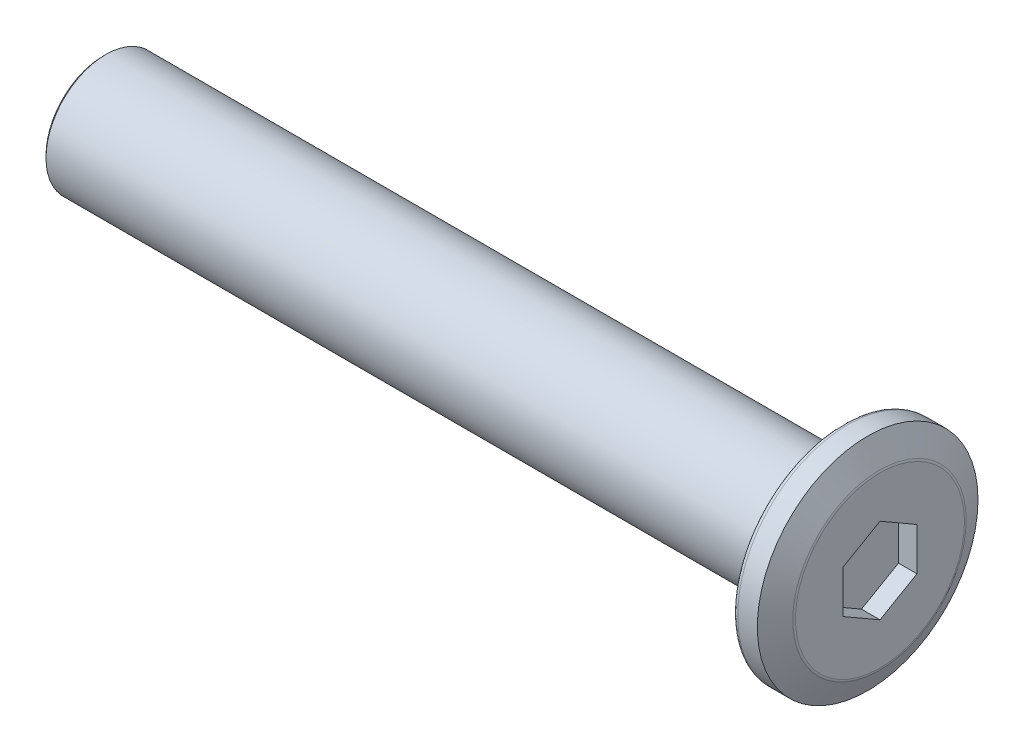
ISO-10303-21;
HEADER;
FILE_DESCRIPTION(('STEP AP214'),'2;1');
FILE_NAME('part.step','',(''),(''),'','','');
FILE_SCHEMA(('AUTOMOTIVE_DESIGN { 1 0 10303 214 1 1 1 1 }'));
ENDSEC;
DATA;
#1=APPLICATION_CONTEXT('core data for automotive mechanical design processes');
#2=APPLICATION_PROTOCOL_DEFINITION('international standard','automotive_design',2000,#1);
#3=PRODUCT_CONTEXT('',#1,'mechanical');
#4=PRODUCT('Part','Part','',(#3));
#5=PRODUCT_RELATED_PRODUCT_CATEGORY('part','',(#4));
#6=PRODUCT_DEFINITION_FORMATION('','',#4);
#7=PRODUCT_DEFINITION_CONTEXT('part definition',#1,'design');
#8=PRODUCT_DEFINITION('design','',#6,#7);
#9=PRODUCT_DEFINITION_SHAPE('','',#8);
#10=(LENGTH_UNIT() NAMED_UNIT(*) SI_UNIT(.MILLI.,.METRE.));
#11=(NAMED_UNIT(*) PLANE_ANGLE_UNIT() SI_UNIT($,.RADIAN.));
#12=(NAMED_UNIT(*) SI_UNIT($,.STERADIAN.) SOLID_ANGLE_UNIT());
#13=UNCERTAINTY_MEASURE_WITH_UNIT(LENGTH_MEASURE(1.E-05),#10,'distance_accuracy_value','');
#14=(GEOMETRIC_REPRESENTATION_CONTEXT(3) GLOBAL_UNCERTAINTY_ASSIGNED_CONTEXT((#13)) GLOBAL_UNIT_ASSIGNED_CONTEXT((#10,
#11,#12)) REPRESENTATION_CONTEXT('',''));
#15=CARTESIAN_POINT('',(0.,0.,0.));
#16=DIRECTION('',(0.,0.,1.));
#17=DIRECTION('',(1.,0.,0.));
#18=AXIS2_PLACEMENT_3D('',#15,#16,#17);
#19=CARTESIAN_POINT('',(0.75,0.,0.));
#20=DIRECTION('',(1.,0.,0.));
#21=DIRECTION('',(0.,0.,-1.));
#22=AXIS2_PLACEMENT_3D('',#19,#20,#21);
#23=PLANE('',#22);
#24=CARTESIAN_POINT('',(0.75,0.,0.));
#25=DIRECTION('',(1.,0.,0.));
#26=DIRECTION('',(0.,0.,-1.));
#27=AXIS2_PLACEMENT_3D('',#24,#25,#26);
#28=CIRCLE('',#27,3.42778640450004);
#29=CARTESIAN_POINT('',(0.75,0.,-3.42778640450004));
#30=VERTEX_POINT('',#29);
#31=EDGE_CURVE('E132',#30,#30,#28,.T.);
#32=ORIENTED_EDGE('',*,*,#31,.T.);
#33=EDGE_LOOP('',(#32));
#34=FACE_BOUND('',#33,.T.);
#35=DIRECTION('',(0.,-1.,0.));
#36=VECTOR('',#35,1.);
#37=CARTESIAN_POINT('',(0.75,0.,-1.5));
#38=LINE('',#37,#36);
#39=CARTESIAN_POINT('',(0.75,0.866025403784438,-1.5));
#40=VERTEX_POINT('',#39);
#41=CARTESIAN_POINT('',(0.75,-0.866025403784439,-1.5));
#42=VERTEX_POINT('',#41);
#43=EDGE_CURVE('E120',#40,#42,#38,.T.);
#44=ORIENTED_EDGE('',*,*,#43,.T.);
#45=DIRECTION('',(0.,-0.5,0.866025403784439));
#46=VECTOR('',#45,1.);
#47=CARTESIAN_POINT('',(0.75,-1.29903810567666,-0.75));
#48=LINE('',#47,#46);
#49=CARTESIAN_POINT('',(0.75,-1.73205080756888,0.));
#50=VERTEX_POINT('',#49);
#51=EDGE_CURVE('E40',#42,#50,#48,.T.);
#52=ORIENTED_EDGE('',*,*,#51,.T.);
#53=DIRECTION('',(0.,0.5,0.866025403784439));
#54=VECTOR('',#53,1.);
#55=CARTESIAN_POINT('',(0.75,-1.29903810567666,0.75));
#56=LINE('',#55,#54);
#57=CARTESIAN_POINT('',(0.75,-0.866025403784438,1.5));
#58=VERTEX_POINT('',#57);
#59=EDGE_CURVE('E76',#50,#58,#56,.T.);
#60=ORIENTED_EDGE('',*,*,#59,.T.);
#61=DIRECTION('',(0.,1.,0.));
#62=VECTOR('',#61,1.);
#63=CARTESIAN_POINT('',(0.75,0.,1.5));
#64=LINE('',#63,#62);
#65=CARTESIAN_POINT('',(0.75,0.866025403784439,1.5));
#66=VERTEX_POINT('',#65);
#67=EDGE_CURVE('E111',#58,#66,#64,.T.);
#68=ORIENTED_EDGE('',*,*,#67,.T.);
#69=DIRECTION('',(0.,0.5,-0.866025403784439));
#70=VECTOR('',#69,1.);
#71=CARTESIAN_POINT('',(0.75,1.29903810567666,0.75));
#72=LINE('',#71,#70);
#73=CARTESIAN_POINT('',(0.75,1.73205080756888,0.));
#74=VERTEX_POINT('',#73);
#75=EDGE_CURVE('E114',#66,#74,#72,.T.);
#76=ORIENTED_EDGE('',*,*,#75,.T.);
#77=DIRECTION('',(0.,-0.5,-0.866025403784439));
#78=VECTOR('',#77,1.);
#79=CARTESIAN_POINT('',(0.75,1.29903810567666,-0.75));
#80=LINE('',#79,#78);
#81=EDGE_CURVE('E117',#74,#40,#80,.T.);
#82=ORIENTED_EDGE('',*,*,#81,.T.);
#83=EDGE_LOOP('',(#44,#52,#60,#68,#76,#82));
#84=FACE_BOUND('',#83,.T.);
#85=ADVANCED_FACE('F16',(#34,#84),#23,.T.);
#86=CARTESIAN_POINT('',(-0.75,0.,0.));
#87=DIRECTION('',(1.,0.,0.));
#88=DIRECTION('',(0.,0.,-1.));
#89=AXIS2_PLACEMENT_3D('',#86,#87,#88);
#90=PLANE('',#89);
#91=CARTESIAN_POINT('',(-0.75,0.,0.));
#92=DIRECTION('',(1.,0.,0.));
#93=DIRECTION('',(0.,0.,-1.));
#94=AXIS2_PLACEMENT_3D('',#91,#92,#93);
#95=CIRCLE('',#94,4.275);
#96=CARTESIAN_POINT('',(-0.75,0.,-4.275));
#97=VERTEX_POINT('',#96);
#98=EDGE_CURVE('E141',#97,#97,#95,.F.);
#99=ORIENTED_EDGE('',*,*,#98,.T.);
#100=EDGE_LOOP('',(#99));
#101=FACE_BOUND('',#100,.T.);
#102=CARTESIAN_POINT('',(-0.75,0.,0.));
#103=DIRECTION('',(1.,0.,0.));
#104=DIRECTION('',(0.,0.,-1.));
#105=AXIS2_PLACEMENT_3D('',#102,#103,#104);
#106=CIRCLE('',#105,2.675);
#107=CARTESIAN_POINT('',(-0.75,0.,-2.675));
#108=VERTEX_POINT('',#107);
#109=EDGE_CURVE('E129',#108,#108,#106,.T.);
#110=ORIENTED_EDGE('',*,*,#109,.T.);
#111=EDGE_LOOP('',(#110));
#112=FACE_BOUND('',#111,.T.);
#113=ADVANCED_FACE('F159',(#101,#112),#90,.F.);
#114=CARTESIAN_POINT('',(0.75,0.,0.));
#115=DIRECTION('',(-1.,0.,0.));
#116=DIRECTION('',(0.,0.,1.));
#117=AXIS2_PLACEMENT_3D('',#114,#115,#116);
#118=CYLINDRICAL_SURFACE('',#117,4.475);
#119=CARTESIAN_POINT('',(-0.55,0.,0.));
#120=DIRECTION('',(1.,0.,0.));
#121=DIRECTION('',(0.,0.,-1.));
#122=AXIS2_PLACEMENT_3D('',#119,#120,#121);
#123=CIRCLE('',#122,4.475);
#124=CARTESIAN_POINT('',(-0.55,0.,-4.475));
#125=VERTEX_POINT('',#124);
#126=EDGE_CURVE('E138',#125,#125,#123,.T.);
#127=ORIENTED_EDGE('',*,*,#126,.T.);
#128=EDGE_LOOP('',(#127));
#129=FACE_BOUND('',#128,.T.);
#130=CARTESIAN_POINT('',(0.250000000000004,0.,0.));
#131=DIRECTION('',(1.,0.,0.));
#132=DIRECTION('',(0.,0.,-1.));
#133=AXIS2_PLACEMENT_3D('',#130,#131,#132);
#134=CIRCLE('',#133,4.475);
#135=CARTESIAN_POINT('',(0.250000000000004,0.,-4.475));
#136=VERTEX_POINT('',#135);
#137=EDGE_CURVE('E123',#136,#136,#134,.F.);
#138=ORIENTED_EDGE('',*,*,#137,.T.);
#139=EDGE_LOOP('',(#138));
#140=FACE_BOUND('',#139,.T.);
#141=ADVANCED_FACE('F165',(#129,#140),#118,.T.);
#142=CARTESIAN_POINT('',(-30.75,0.,0.));
#143=DIRECTION('',(1.,0.,0.));
#144=DIRECTION('',(0.,0.,-1.));
#145=AXIS2_PLACEMENT_3D('',#142,#143,#144);
#146=CYLINDRICAL_SURFACE('',#145,2.425);
#147=CARTESIAN_POINT('',(-30.65,0.,0.));
#148=DIRECTION('',(-1.,0.,0.));
#149=DIRECTION('',(0.,0.,1.));
#150=AXIS2_PLACEMENT_3D('',#147,#148,#149);
#151=CIRCLE('',#150,2.425);
#152=CARTESIAN_POINT('',(-30.65,0.,2.425));
#153=VERTEX_POINT('',#152);
#154=EDGE_CURVE('E10',#153,#153,#151,.F.);
#155=ORIENTED_EDGE('',*,*,#154,.T.);
#156=EDGE_LOOP('',(#155));
#157=FACE_BOUND('',#156,.T.);
#158=CARTESIAN_POINT('',(-1.,0.,0.));
#159=DIRECTION('',(1.,0.,0.));
#160=DIRECTION('',(0.,0.,-1.));
#161=AXIS2_PLACEMENT_3D('',#158,#159,#160);
#162=CIRCLE('',#161,2.425);
#163=CARTESIAN_POINT('',(-1.,0.,-2.425));
#164=VERTEX_POINT('',#163);
#165=EDGE_CURVE('E126',#164,#164,#162,.F.);
#166=ORIENTED_EDGE('',*,*,#165,.T.);
#167=EDGE_LOOP('',(#166));
#168=FACE_BOUND('',#167,.T.);
#169=ADVANCED_FACE('F170',(#157,#168),#146,.T.);
#170=CARTESIAN_POINT('',(-30.75,0.,0.));
#171=DIRECTION('',(-1.,0.,0.));
#172=DIRECTION('',(0.,0.,1.));
#173=AXIS2_PLACEMENT_3D('',#170,#171,#172);
#174=PLANE('',#173);
#175=CARTESIAN_POINT('',(-30.75,0.,0.));
#176=DIRECTION('',(-1.,0.,0.));
#177=DIRECTION('',(0.,0.,1.));
#178=AXIS2_PLACEMENT_3D('',#175,#176,#177);
#179=CIRCLE('',#178,2.325);
#180=CARTESIAN_POINT('',(-30.75,0.,2.325));
#181=VERTEX_POINT('',#180);
#182=EDGE_CURVE('E25',#181,#181,#179,.T.);
#183=ORIENTED_EDGE('',*,*,#182,.T.);
#184=EDGE_LOOP('',(#183));
#185=FACE_BOUND('',#184,.T.);
#186=ADVANCED_FACE('F146',(#185),#174,.T.);
#187=CARTESIAN_POINT('',(2.,-1.73205080756888,0.));
#188=DIRECTION('',(0.,0.866025403784439,0.5));
#189=DIRECTION('',(0.,-0.5,0.866025403784439));
#190=AXIS2_PLACEMENT_3D('',#187,#188,#189);
#191=PLANE('',#190);
#192=DIRECTION('',(-1.,0.,0.));
#193=VECTOR('',#192,1.);
#194=CARTESIAN_POINT('',(2.,-0.866025403784439,-1.5));
#195=LINE('',#194,#193);
#196=CARTESIAN_POINT('',(0.,-0.866025403784439,-1.5));
#197=VERTEX_POINT('',#196);
#198=EDGE_CURVE('E69',#42,#197,#195,.T.);
#199=ORIENTED_EDGE('',*,*,#198,.T.);
#200=DIRECTION('',(0.,0.5,-0.866025403784439));
#201=VECTOR('',#200,1.);
#202=CARTESIAN_POINT('',(0.,-1.73205080756888,0.));
#203=LINE('',#202,#201);
#204=CARTESIAN_POINT('',(0.,-1.73205080756888,0.));
#205=VERTEX_POINT('',#204);
#206=EDGE_CURVE('E73',#205,#197,#203,.T.);
#207=ORIENTED_EDGE('',*,*,#206,.F.);
#208=DIRECTION('',(-1.,0.,0.));
#209=VECTOR('',#208,1.);
#210=CARTESIAN_POINT('',(2.,-1.73205080756888,0.));
#211=LINE('',#210,#209);
#212=EDGE_CURVE('E101',#50,#205,#211,.T.);
#213=ORIENTED_EDGE('',*,*,#212,.F.);
#214=ORIENTED_EDGE('',*,*,#51,.F.);
#215=EDGE_LOOP('',(#199,#207,#213,#214));
#216=FACE_BOUND('',#215,.T.);
#217=ADVANCED_FACE('F71',(#216),#191,.T.);
#218=CARTESIAN_POINT('',(2.,-0.866025403784439,-1.5));
#219=DIRECTION('',(0.,0.,1.));
#220=DIRECTION('',(1.,0.,0.));
#221=AXIS2_PLACEMENT_3D('',#218,#219,#220);
#222=PLANE('',#221);
#223=DIRECTION('',(-1.,0.,0.));
#224=VECTOR('',#223,1.);
#225=CARTESIAN_POINT('',(2.,0.866025403784438,-1.5));
#226=LINE('',#225,#224);
#227=CARTESIAN_POINT('',(0.,0.866025403784438,-1.5));
#228=VERTEX_POINT('',#227);
#229=EDGE_CURVE('E77',#40,#228,#226,.T.);
#230=ORIENTED_EDGE('',*,*,#229,.T.);
#231=DIRECTION('',(0.,1.,0.));
#232=VECTOR('',#231,1.);
#233=CARTESIAN_POINT('',(0.,-0.866025403784439,-1.5));
#234=LINE('',#233,#232);
#235=EDGE_CURVE('E80',#197,#228,#234,.T.);
#236=ORIENTED_EDGE('',*,*,#235,.F.);
#237=ORIENTED_EDGE('',*,*,#198,.F.);
#238=ORIENTED_EDGE('',*,*,#43,.F.);
#239=EDGE_LOOP('',(#230,#236,#237,#238));
#240=FACE_BOUND('',#239,.T.);
#241=ADVANCED_FACE('F81',(#240),#222,.T.);
#242=CARTESIAN_POINT('',(2.,0.866025403784438,-1.5));
#243=DIRECTION('',(0.,-0.866025403784439,0.5));
#244=DIRECTION('',(0.,-0.5,-0.866025403784439));
#245=AXIS2_PLACEMENT_3D('',#242,#243,#244);
#246=PLANE('',#245);
#247=DIRECTION('',(-1.,0.,0.));
#248=VECTOR('',#247,1.);
#249=CARTESIAN_POINT('',(2.,1.73205080756888,0.));
#250=LINE('',#249,#248);
#251=CARTESIAN_POINT('',(0.,1.73205080756888,0.));
#252=VERTEX_POINT('',#251);
#253=EDGE_CURVE('E106',#74,#252,#250,.T.);
#254=ORIENTED_EDGE('',*,*,#253,.T.);
#255=DIRECTION('',(0.,0.5,0.866025403784438));
#256=VECTOR('',#255,1.);
#257=CARTESIAN_POINT('',(0.,0.866025403784438,-1.5));
#258=LINE('',#257,#256);
#259=EDGE_CURVE('E86',#228,#252,#258,.T.);
#260=ORIENTED_EDGE('',*,*,#259,.F.);
#261=ORIENTED_EDGE('',*,*,#229,.F.);
#262=ORIENTED_EDGE('',*,*,#81,.F.);
#263=EDGE_LOOP('',(#254,#260,#261,#262));
#264=FACE_BOUND('',#263,.T.);
#265=ADVANCED_FACE('F288',(#264),#246,.T.);
#266=CARTESIAN_POINT('',(2.,1.73205080756888,0.));
#267=DIRECTION('',(0.,-0.866025403784439,-0.5));
#268=DIRECTION('',(0.,0.5,-0.866025403784439));
#269=AXIS2_PLACEMENT_3D('',#266,#267,#268);
#270=PLANE('',#269);
#271=DIRECTION('',(-1.,0.,0.));
#272=VECTOR('',#271,1.);
#273=CARTESIAN_POINT('',(2.,0.866025403784439,1.5));
#274=LINE('',#273,#272);
#275=CARTESIAN_POINT('',(0.,0.866025403784439,1.5));
#276=VERTEX_POINT('',#275);
#277=EDGE_CURVE('E104',#66,#276,#274,.T.);
#278=ORIENTED_EDGE('',*,*,#277,.T.);
#279=DIRECTION('',(0.,-0.5,0.866025403784439));
#280=VECTOR('',#279,1.);
#281=CARTESIAN_POINT('',(0.,1.73205080756888,0.));
#282=LINE('',#281,#280);
#283=EDGE_CURVE('E95',#252,#276,#282,.T.);
#284=ORIENTED_EDGE('',*,*,#283,.F.);
#285=ORIENTED_EDGE('',*,*,#253,.F.);
#286=ORIENTED_EDGE('',*,*,#75,.F.);
#287=EDGE_LOOP('',(#278,#284,#285,#286));
#288=FACE_BOUND('',#287,.T.);
#289=ADVANCED_FACE('F279',(#288),#270,.T.);
#290=CARTESIAN_POINT('',(2.,0.866025403784439,1.5));
#291=DIRECTION('',(0.,0.,-1.));
#292=DIRECTION('',(-1.,0.,0.));
#293=AXIS2_PLACEMENT_3D('',#290,#291,#292);
#294=PLANE('',#293);
#295=DIRECTION('',(-1.,0.,0.));
#296=VECTOR('',#295,1.);
#297=CARTESIAN_POINT('',(2.,-0.866025403784438,1.5));
#298=LINE('',#297,#296);
#299=CARTESIAN_POINT('',(0.,-0.866025403784438,1.5));
#300=VERTEX_POINT('',#299);
#301=EDGE_CURVE('E32',#58,#300,#298,.T.);
#302=ORIENTED_EDGE('',*,*,#301,.T.);
#303=DIRECTION('',(0.,-1.,0.));
#304=VECTOR('',#303,1.);
#305=CARTESIAN_POINT('',(0.,0.866025403784439,1.5));
#306=LINE('',#305,#304);
#307=EDGE_CURVE('E98',#276,#300,#306,.T.);
#308=ORIENTED_EDGE('',*,*,#307,.F.);
#309=ORIENTED_EDGE('',*,*,#277,.F.);
#310=ORIENTED_EDGE('',*,*,#67,.F.);
#311=EDGE_LOOP('',(#302,#308,#309,#310));
#312=FACE_BOUND('',#311,.T.);
#313=ADVANCED_FACE('F271',(#312),#294,.T.);
#314=CARTESIAN_POINT('',(2.,-0.866025403784438,1.5));
#315=DIRECTION('',(0.,0.866025403784438,-0.5));
#316=DIRECTION('',(0.,0.5,0.866025403784439));
#317=AXIS2_PLACEMENT_3D('',#314,#315,#316);
#318=PLANE('',#317);
#319=ORIENTED_EDGE('',*,*,#212,.T.);
#320=DIRECTION('',(0.,-0.5,-0.866025403784438));
#321=VECTOR('',#320,1.);
#322=CARTESIAN_POINT('',(0.,-0.866025403784438,1.5));
#323=LINE('',#322,#321);
#324=EDGE_CURVE('E91',#300,#205,#323,.T.);
#325=ORIENTED_EDGE('',*,*,#324,.F.);
#326=ORIENTED_EDGE('',*,*,#301,.F.);
#327=ORIENTED_EDGE('',*,*,#59,.F.);
#328=EDGE_LOOP('',(#319,#325,#326,#327));
#329=FACE_BOUND('',#328,.T.);
#330=ADVANCED_FACE('F263',(#329),#318,.T.);
#331=CARTESIAN_POINT('',(0.,0.,0.));
#332=DIRECTION('',(1.,0.,0.));
#333=DIRECTION('',(0.,0.,-1.));
#334=AXIS2_PLACEMENT_3D('',#331,#332,#333);
#335=PLANE('',#334);
#336=ORIENTED_EDGE('',*,*,#206,.T.);
#337=ORIENTED_EDGE('',*,*,#235,.T.);
#338=ORIENTED_EDGE('',*,*,#259,.T.);
#339=ORIENTED_EDGE('',*,*,#283,.T.);
#340=ORIENTED_EDGE('',*,*,#307,.T.);
#341=ORIENTED_EDGE('',*,*,#324,.T.);
#342=EDGE_LOOP('',(#336,#337,#338,#339,#340,#341));
#343=FACE_BOUND('',#342,.T.);
#344=ADVANCED_FACE('F89',(#343),#335,.T.);
#345=CARTESIAN_POINT('',(0.75,0.,0.));
#346=DIRECTION('',(-1.,0.,0.));
#347=DIRECTION('',(0.,0.,1.));
#348=AXIS2_PLACEMENT_3D('',#345,#346,#347);
#349=CONICAL_SURFACE('',#348,3.475,1.10714871779409);
#350=CARTESIAN_POINT('',(0.728885438199984,0.,0.));
#351=DIRECTION('',(1.,0.,0.));
#352=DIRECTION('',(0.,0.,-1.));
#353=AXIS2_PLACEMENT_3D('',#350,#351,#352);
#354=CIRCLE('',#353,3.51722912360003);
#355=CARTESIAN_POINT('',(0.728885438199984,0.,-3.51722912360003));
#356=VERTEX_POINT('',#355);
#357=EDGE_CURVE('E135',#356,#356,#354,.F.);
#358=ORIENTED_EDGE('',*,*,#357,.T.);
#359=EDGE_LOOP('',(#358));
#360=FACE_BOUND('',#359,.T.);
#361=ORIENTED_EDGE('',*,*,#137,.F.);
#362=EDGE_LOOP('',(#361));
#363=FACE_BOUND('',#362,.T.);
#364=ADVANCED_FACE('F176',(#360,#363),#349,.T.);
#365=CARTESIAN_POINT('',(-1.,0.,0.));
#366=DIRECTION('',(1.,0.,0.));
#367=DIRECTION('',(0.,0.,-1.));
#368=AXIS2_PLACEMENT_3D('',#365,#366,#367);
#369=TOROIDAL_SURFACE('',#368,2.675,0.25);
#370=ORIENTED_EDGE('',*,*,#109,.F.);
#371=EDGE_LOOP('',(#370));
#372=FACE_BOUND('',#371,.T.);
#373=ORIENTED_EDGE('',*,*,#165,.F.);
#374=EDGE_LOOP('',(#373));
#375=FACE_BOUND('',#374,.T.);
#376=ADVANCED_FACE('F179',(#372,#375),#369,.F.);
#377=CARTESIAN_POINT('',(0.55,0.,0.));
#378=DIRECTION('',(1.,0.,0.));
#379=DIRECTION('',(0.,0.,-1.));
#380=AXIS2_PLACEMENT_3D('',#377,#378,#379);
#381=TOROIDAL_SURFACE('',#380,3.42778640450004,0.2);
#382=ORIENTED_EDGE('',*,*,#357,.F.);
#383=EDGE_LOOP('',(#382));
#384=FACE_BOUND('',#383,.T.);
#385=ORIENTED_EDGE('',*,*,#31,.F.);
#386=EDGE_LOOP('',(#385));
#387=FACE_BOUND('',#386,.T.);
#388=ADVANCED_FACE('F155',(#384,#387),#381,.T.);
#389=CARTESIAN_POINT('',(-0.55,0.,0.));
#390=DIRECTION('',(1.,0.,0.));
#391=DIRECTION('',(0.,0.,-1.));
#392=AXIS2_PLACEMENT_3D('',#389,#390,#391);
#393=TOROIDAL_SURFACE('',#392,4.275,0.2);
#394=ORIENTED_EDGE('',*,*,#98,.F.);
#395=EDGE_LOOP('',(#394));
#396=FACE_BOUND('',#395,.T.);
#397=ORIENTED_EDGE('',*,*,#126,.F.);
#398=EDGE_LOOP('',(#397));
#399=FACE_BOUND('',#398,.T.);
#400=ADVANCED_FACE('F149',(#396,#399),#393,.T.);
#401=CARTESIAN_POINT('',(-30.75,0.,0.));
#402=DIRECTION('',(1.,0.,0.));
#403=DIRECTION('',(0.,0.,-1.));
#404=AXIS2_PLACEMENT_3D('',#401,#402,#403);
#405=CONICAL_SURFACE('',#404,2.325,0.785398163397414);
#406=ORIENTED_EDGE('',*,*,#154,.F.);
#407=EDGE_LOOP('',(#406));
#408=FACE_BOUND('',#407,.T.);
#409=ORIENTED_EDGE('',*,*,#182,.F.);
#410=EDGE_LOOP('',(#409));
#411=FACE_BOUND('',#410,.T.);
#412=ADVANCED_FACE('F19',(#408,#411),#405,.T.);
#413=CLOSED_SHELL('',(#85,#113,#141,#169,#186,#217,#241,#265,#289,#313,#330,#344,#364,#376,#388,
#400,#412));
#414=MANIFOLD_SOLID_BREP('B1',#413);
#415=ADVANCED_BREP_SHAPE_REPRESENTATION('',(#18,#414),#14);
#416=SHAPE_DEFINITION_REPRESENTATION(#9,#415);
ENDSEC;
END-ISO-10303-21;
